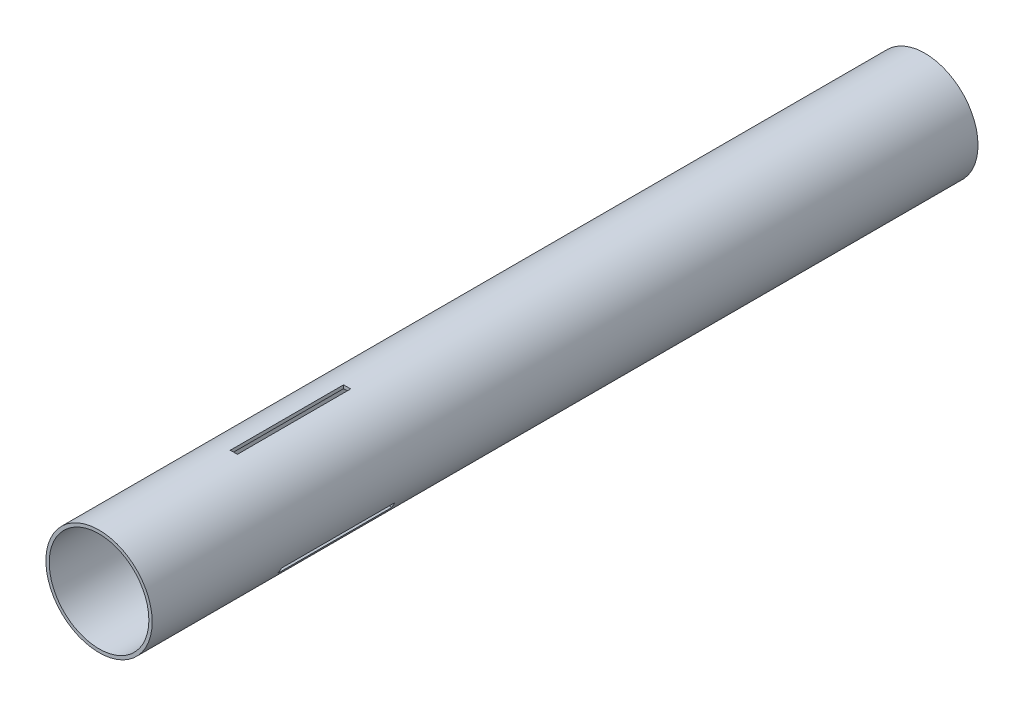
ISO-10303-21;
HEADER;
FILE_DESCRIPTION(('STEP AP214'),'2;1');
FILE_NAME('part.step','',(''),(''),'','','');
FILE_SCHEMA(('AUTOMOTIVE_DESIGN { 1 0 10303 214 1 1 1 1 }'));
ENDSEC;
DATA;
#1=APPLICATION_CONTEXT('core data for automotive mechanical design processes');
#2=APPLICATION_PROTOCOL_DEFINITION('international standard','automotive_design',2000,#1);
#3=PRODUCT_CONTEXT('',#1,'mechanical');
#4=PRODUCT('Part','Part','',(#3));
#5=PRODUCT_RELATED_PRODUCT_CATEGORY('part','',(#4));
#6=PRODUCT_DEFINITION_FORMATION('','',#4);
#7=PRODUCT_DEFINITION_CONTEXT('part definition',#1,'design');
#8=PRODUCT_DEFINITION('design','',#6,#7);
#9=PRODUCT_DEFINITION_SHAPE('','',#8);
#10=(LENGTH_UNIT() NAMED_UNIT(*) SI_UNIT(.MILLI.,.METRE.));
#11=(NAMED_UNIT(*) PLANE_ANGLE_UNIT() SI_UNIT($,.RADIAN.));
#12=(NAMED_UNIT(*) SI_UNIT($,.STERADIAN.) SOLID_ANGLE_UNIT());
#13=UNCERTAINTY_MEASURE_WITH_UNIT(LENGTH_MEASURE(1.E-05),#10,'distance_accuracy_value','');
#14=(GEOMETRIC_REPRESENTATION_CONTEXT(3) GLOBAL_UNCERTAINTY_ASSIGNED_CONTEXT((#13)) GLOBAL_UNIT_ASSIGNED_CONTEXT((#10,
#11,#12)) REPRESENTATION_CONTEXT('',''));
#15=CARTESIAN_POINT('',(0.,0.,0.));
#16=DIRECTION('',(0.,0.,1.));
#17=DIRECTION('',(1.,0.,0.));
#18=AXIS2_PLACEMENT_3D('',#15,#16,#17);
#19=CARTESIAN_POINT('',(0.,0.,368.3));
#20=DIRECTION('',(0.,0.,1.));
#21=DIRECTION('',(1.,0.,0.));
#22=AXIS2_PLACEMENT_3D('',#19,#20,#21);
#23=PLANE('',#22);
#24=CARTESIAN_POINT('',(0.,0.,368.3));
#25=DIRECTION('',(0.,0.,1.));
#26=DIRECTION('',(1.,0.,0.));
#27=AXIS2_PLACEMENT_3D('',#24,#25,#26);
#28=CIRCLE('',#27,23.6982);
#29=CARTESIAN_POINT('',(23.6982,0.,368.3));
#30=VERTEX_POINT('',#29);
#31=EDGE_CURVE('E11',#30,#30,#28,.T.);
#32=ORIENTED_EDGE('',*,*,#31,.T.);
#33=EDGE_LOOP('',(#32));
#34=FACE_BOUND('',#33,.T.);
#35=CARTESIAN_POINT('',(0.,0.,368.3));
#36=DIRECTION('',(0.,0.,1.));
#37=DIRECTION('',(1.,0.,0.));
#38=AXIS2_PLACEMENT_3D('',#35,#36,#37);
#39=CIRCLE('',#38,22.225);
#40=CARTESIAN_POINT('',(22.225,0.,368.3));
#41=VERTEX_POINT('',#40);
#42=EDGE_CURVE('E225',#41,#41,#39,.T.);
#43=ORIENTED_EDGE('',*,*,#42,.F.);
#44=EDGE_LOOP('',(#43));
#45=FACE_BOUND('',#44,.T.);
#46=ADVANCED_FACE('F33',(#34,#45),#23,.T.);
#47=CARTESIAN_POINT('',(0.,0.,0.));
#48=DIRECTION('',(0.,0.,1.));
#49=DIRECTION('',(1.,0.,0.));
#50=AXIS2_PLACEMENT_3D('',#47,#48,#49);
#51=PLANE('',#50);
#52=CARTESIAN_POINT('',(0.,0.,0.));
#53=DIRECTION('',(0.,0.,1.));
#54=DIRECTION('',(1.,0.,0.));
#55=AXIS2_PLACEMENT_3D('',#52,#53,#54);
#56=CIRCLE('',#55,23.6982);
#57=CARTESIAN_POINT('',(23.6982,0.,0.));
#58=VERTEX_POINT('',#57);
#59=EDGE_CURVE('E37',#58,#58,#56,.T.);
#60=ORIENTED_EDGE('',*,*,#59,.F.);
#61=EDGE_LOOP('',(#60));
#62=FACE_BOUND('',#61,.T.);
#63=CARTESIAN_POINT('',(0.,0.,0.));
#64=DIRECTION('',(0.,0.,1.));
#65=DIRECTION('',(1.,0.,0.));
#66=AXIS2_PLACEMENT_3D('',#63,#64,#65);
#67=CIRCLE('',#66,22.225);
#68=CARTESIAN_POINT('',(22.225,0.,0.));
#69=VERTEX_POINT('',#68);
#70=EDGE_CURVE('E224',#69,#69,#67,.T.);
#71=ORIENTED_EDGE('',*,*,#70,.T.);
#72=EDGE_LOOP('',(#71));
#73=FACE_BOUND('',#72,.T.);
#74=ADVANCED_FACE('F231',(#62,#73),#51,.F.);
#75=CARTESIAN_POINT('',(0.,0.,368.3));
#76=DIRECTION('',(0.,0.,-1.));
#77=DIRECTION('',(-1.,0.,0.));
#78=AXIS2_PLACEMENT_3D('',#75,#76,#77);
#79=CYLINDRICAL_SURFACE('',#78,23.6982);
#80=CARTESIAN_POINT('',(0.,0.,257.683));
#81=DIRECTION('',(0.,0.,-1.));
#82=DIRECTION('',(0.,1.,0.));
#83=AXIS2_PLACEMENT_3D('',#80,#81,#82);
#84=CIRCLE('',#83,23.6982);
#85=CARTESIAN_POINT('',(-21.2708932392924,-10.4476688329323,257.683));
#86=VERTEX_POINT('',#85);
#87=CARTESIAN_POINT('',(-19.6833932392924,-13.1972994899479,257.683));
#88=VERTEX_POINT('',#87);
#89=EDGE_CURVE('E138',#86,#88,#84,.F.);
#90=ORIENTED_EDGE('',*,*,#89,.F.);
#91=DIRECTION('',(0.,0.,-1.));
#92=VECTOR('',#91,1.);
#93=CARTESIAN_POINT('',(-21.2708932392924,-10.4476688329323,368.3));
#94=LINE('',#93,#92);
#95=CARTESIAN_POINT('',(-21.2708932392924,-10.4476688329323,308.229));
#96=VERTEX_POINT('',#95);
#97=EDGE_CURVE('E163',#96,#86,#94,.T.);
#98=ORIENTED_EDGE('',*,*,#97,.F.);
#99=CARTESIAN_POINT('',(0.,0.,308.229));
#100=DIRECTION('',(0.,0.,1.));
#101=DIRECTION('',(1.,0.,0.));
#102=AXIS2_PLACEMENT_3D('',#99,#100,#101);
#103=CIRCLE('',#102,23.6982);
#104=CARTESIAN_POINT('',(-19.6833932392924,-13.1972994899479,308.229));
#105=VERTEX_POINT('',#104);
#106=EDGE_CURVE('E155',#105,#96,#103,.F.);
#107=ORIENTED_EDGE('',*,*,#106,.F.);
#108=DIRECTION('',(0.,0.,-1.));
#109=VECTOR('',#108,1.);
#110=CARTESIAN_POINT('',(-19.6833932392924,-13.1972994899479,368.3));
#111=LINE('',#110,#109);
#112=EDGE_CURVE('E48',#88,#105,#111,.F.);
#113=ORIENTED_EDGE('',*,*,#112,.F.);
#114=EDGE_LOOP('',(#90,#98,#107,#113));
#115=FACE_BOUND('',#114,.T.);
#116=CARTESIAN_POINT('',(0.,0.,257.683));
#117=DIRECTION('',(0.,0.,-1.));
#118=DIRECTION('',(0.,1.,0.));
#119=AXIS2_PLACEMENT_3D('',#116,#117,#118);
#120=CIRCLE('',#119,23.6982);
#121=CARTESIAN_POINT('',(19.6833932392926,-13.1972994899476,257.683));
#122=VERTEX_POINT('',#121);
#123=CARTESIAN_POINT('',(21.2708932392925,-10.447668832932,257.683));
#124=VERTEX_POINT('',#123);
#125=EDGE_CURVE('E176',#122,#124,#120,.F.);
#126=ORIENTED_EDGE('',*,*,#125,.F.);
#127=DIRECTION('',(0.,0.,-1.));
#128=VECTOR('',#127,1.);
#129=CARTESIAN_POINT('',(19.6833932392926,-13.1972994899476,368.3));
#130=LINE('',#129,#128);
#131=CARTESIAN_POINT('',(19.6833932392926,-13.1972994899476,308.229));
#132=VERTEX_POINT('',#131);
#133=EDGE_CURVE('E146',#132,#122,#130,.T.);
#134=ORIENTED_EDGE('',*,*,#133,.F.);
#135=CARTESIAN_POINT('',(0.,0.,308.229));
#136=DIRECTION('',(0.,0.,1.));
#137=DIRECTION('',(1.,0.,0.));
#138=AXIS2_PLACEMENT_3D('',#135,#136,#137);
#139=CIRCLE('',#138,23.6982);
#140=CARTESIAN_POINT('',(21.2708932392925,-10.447668832932,308.229));
#141=VERTEX_POINT('',#140);
#142=EDGE_CURVE('E180',#141,#132,#139,.F.);
#143=ORIENTED_EDGE('',*,*,#142,.F.);
#144=DIRECTION('',(0.,0.,-1.));
#145=VECTOR('',#144,1.);
#146=CARTESIAN_POINT('',(21.2708932392925,-10.447668832932,368.3));
#147=LINE('',#146,#145);
#148=EDGE_CURVE('E56',#124,#141,#147,.F.);
#149=ORIENTED_EDGE('',*,*,#148,.F.);
#150=EDGE_LOOP('',(#126,#134,#143,#149));
#151=FACE_BOUND('',#150,.T.);
#152=CARTESIAN_POINT('',(0.,0.,257.683));
#153=DIRECTION('',(0.,0.,-1.));
#154=DIRECTION('',(-1.,0.,0.));
#155=AXIS2_PLACEMENT_3D('',#152,#153,#154);
#156=CIRCLE('',#155,23.6982);
#157=CARTESIAN_POINT('',(1.5875,23.64496832288,257.683));
#158=VERTEX_POINT('',#157);
#159=CARTESIAN_POINT('',(-1.5875,23.64496832288,257.683));
#160=VERTEX_POINT('',#159);
#161=EDGE_CURVE('E201',#158,#160,#156,.F.);
#162=ORIENTED_EDGE('',*,*,#161,.F.);
#163=DIRECTION('',(0.,0.,-1.));
#164=VECTOR('',#163,1.);
#165=CARTESIAN_POINT('',(1.5875,23.64496832288,368.3));
#166=LINE('',#165,#164);
#167=CARTESIAN_POINT('',(1.5875,23.64496832288,308.229));
#168=VERTEX_POINT('',#167);
#169=EDGE_CURVE('E221',#168,#158,#166,.T.);
#170=ORIENTED_EDGE('',*,*,#169,.F.);
#171=CARTESIAN_POINT('',(0.,0.,308.229));
#172=DIRECTION('',(0.,0.,1.));
#173=DIRECTION('',(1.,0.,0.));
#174=AXIS2_PLACEMENT_3D('',#171,#172,#173);
#175=CIRCLE('',#174,23.6982);
#176=CARTESIAN_POINT('',(-1.5875,23.64496832288,308.229));
#177=VERTEX_POINT('',#176);
#178=EDGE_CURVE('E206',#177,#168,#175,.F.);
#179=ORIENTED_EDGE('',*,*,#178,.F.);
#180=DIRECTION('',(0.,0.,-1.));
#181=VECTOR('',#180,1.);
#182=CARTESIAN_POINT('',(-1.5875,23.64496832288,368.3));
#183=LINE('',#182,#181);
#184=EDGE_CURVE('E204',#160,#177,#183,.F.);
#185=ORIENTED_EDGE('',*,*,#184,.F.);
#186=EDGE_LOOP('',(#162,#170,#179,#185));
#187=FACE_BOUND('',#186,.T.);
#188=ORIENTED_EDGE('',*,*,#31,.F.);
#189=EDGE_LOOP('',(#188));
#190=FACE_BOUND('',#189,.T.);
#191=ORIENTED_EDGE('',*,*,#59,.T.);
#192=EDGE_LOOP('',(#191));
#193=FACE_BOUND('',#192,.T.);
#194=ADVANCED_FACE('F35',(#115,#151,#187,#190,#193),#79,.T.);
#195=CARTESIAN_POINT('',(0.,0.,368.3));
#196=DIRECTION('',(0.,0.,-1.));
#197=DIRECTION('',(-1.,0.,0.));
#198=AXIS2_PLACEMENT_3D('',#195,#196,#197);
#199=CYLINDRICAL_SURFACE('',#198,22.225);
#200=DIRECTION('',(0.,0.,-1.));
#201=VECTOR('',#200,1.);
#202=CARTESIAN_POINT('',(-19.9920012631359,-9.70930020623389,368.3));
#203=LINE('',#202,#201);
#204=CARTESIAN_POINT('',(-19.9920012631359,-9.70930020623389,308.229));
#205=VERTEX_POINT('',#204);
#206=CARTESIAN_POINT('',(-19.9920012631359,-9.70930020623389,257.683));
#207=VERTEX_POINT('',#206);
#208=EDGE_CURVE('E145',#205,#207,#203,.T.);
#209=ORIENTED_EDGE('',*,*,#208,.T.);
#210=CARTESIAN_POINT('',(0.,0.,257.683));
#211=DIRECTION('',(0.,0.,-1.));
#212=DIRECTION('',(0.,1.,0.));
#213=AXIS2_PLACEMENT_3D('',#210,#211,#212);
#214=CIRCLE('',#213,22.225);
#215=CARTESIAN_POINT('',(-18.4045012631359,-12.4589308632495,257.683));
#216=VERTEX_POINT('',#215);
#217=EDGE_CURVE('E132',#207,#216,#214,.F.);
#218=ORIENTED_EDGE('',*,*,#217,.T.);
#219=DIRECTION('',(0.,0.,-1.));
#220=VECTOR('',#219,1.);
#221=CARTESIAN_POINT('',(-18.4045012631359,-12.4589308632495,368.3));
#222=LINE('',#221,#220);
#223=CARTESIAN_POINT('',(-18.4045012631359,-12.4589308632495,308.229));
#224=VERTEX_POINT('',#223);
#225=EDGE_CURVE('E122',#216,#224,#222,.F.);
#226=ORIENTED_EDGE('',*,*,#225,.T.);
#227=CARTESIAN_POINT('',(0.,0.,308.229));
#228=DIRECTION('',(0.,0.,1.));
#229=DIRECTION('',(1.,0.,0.));
#230=AXIS2_PLACEMENT_3D('',#227,#228,#229);
#231=CIRCLE('',#230,22.225);
#232=EDGE_CURVE('E131',#224,#205,#231,.F.);
#233=ORIENTED_EDGE('',*,*,#232,.T.);
#234=EDGE_LOOP('',(#209,#218,#226,#233));
#235=FACE_BOUND('',#234,.T.);
#236=DIRECTION('',(0.,0.,-1.));
#237=VECTOR('',#236,1.);
#238=CARTESIAN_POINT('',(18.404501263136,-12.4589308632492,368.3));
#239=LINE('',#238,#237);
#240=CARTESIAN_POINT('',(18.404501263136,-12.4589308632492,308.229));
#241=VERTEX_POINT('',#240);
#242=CARTESIAN_POINT('',(18.404501263136,-12.4589308632492,257.683));
#243=VERTEX_POINT('',#242);
#244=EDGE_CURVE('E149',#241,#243,#239,.T.);
#245=ORIENTED_EDGE('',*,*,#244,.T.);
#246=CARTESIAN_POINT('',(0.,0.,257.683));
#247=DIRECTION('',(0.,0.,-1.));
#248=DIRECTION('',(0.,1.,0.));
#249=AXIS2_PLACEMENT_3D('',#246,#247,#248);
#250=CIRCLE('',#249,22.225);
#251=CARTESIAN_POINT('',(19.992001263136,-9.70930020623361,257.683));
#252=VERTEX_POINT('',#251);
#253=EDGE_CURVE('E167',#243,#252,#250,.F.);
#254=ORIENTED_EDGE('',*,*,#253,.T.);
#255=DIRECTION('',(0.,0.,-1.));
#256=VECTOR('',#255,1.);
#257=CARTESIAN_POINT('',(19.992001263136,-9.70930020623361,368.3));
#258=LINE('',#257,#256);
#259=CARTESIAN_POINT('',(19.992001263136,-9.70930020623361,308.229));
#260=VERTEX_POINT('',#259);
#261=EDGE_CURVE('E170',#252,#260,#258,.F.);
#262=ORIENTED_EDGE('',*,*,#261,.T.);
#263=CARTESIAN_POINT('',(0.,0.,308.229));
#264=DIRECTION('',(0.,0.,1.));
#265=DIRECTION('',(1.,0.,0.));
#266=AXIS2_PLACEMENT_3D('',#263,#264,#265);
#267=CIRCLE('',#266,22.225);
#268=EDGE_CURVE('E173',#260,#241,#267,.F.);
#269=ORIENTED_EDGE('',*,*,#268,.T.);
#270=EDGE_LOOP('',(#245,#254,#262,#269));
#271=FACE_BOUND('',#270,.T.);
#272=DIRECTION('',(0.,0.,-1.));
#273=VECTOR('',#272,1.);
#274=CARTESIAN_POINT('',(1.5875,22.1682310694832,368.3));
#275=LINE('',#274,#273);
#276=CARTESIAN_POINT('',(1.5875,22.1682310694832,308.229));
#277=VERTEX_POINT('',#276);
#278=CARTESIAN_POINT('',(1.5875,22.1682310694832,257.683));
#279=VERTEX_POINT('',#278);
#280=EDGE_CURVE('E213',#277,#279,#275,.T.);
#281=ORIENTED_EDGE('',*,*,#280,.T.);
#282=CARTESIAN_POINT('',(0.,0.,257.683));
#283=DIRECTION('',(0.,0.,-1.));
#284=DIRECTION('',(-1.,0.,0.));
#285=AXIS2_PLACEMENT_3D('',#282,#283,#284);
#286=CIRCLE('',#285,22.225);
#287=CARTESIAN_POINT('',(-1.5875,22.1682310694832,257.683));
#288=VERTEX_POINT('',#287);
#289=EDGE_CURVE('E166',#279,#288,#286,.F.);
#290=ORIENTED_EDGE('',*,*,#289,.T.);
#291=DIRECTION('',(0.,0.,-1.));
#292=VECTOR('',#291,1.);
#293=CARTESIAN_POINT('',(-1.5875,22.1682310694832,368.3));
#294=LINE('',#293,#292);
#295=CARTESIAN_POINT('',(-1.5875,22.1682310694832,308.229));
#296=VERTEX_POINT('',#295);
#297=EDGE_CURVE('E195',#288,#296,#294,.F.);
#298=ORIENTED_EDGE('',*,*,#297,.T.);
#299=CARTESIAN_POINT('',(0.,0.,308.229));
#300=DIRECTION('',(0.,0.,1.));
#301=DIRECTION('',(1.,0.,0.));
#302=AXIS2_PLACEMENT_3D('',#299,#300,#301);
#303=CIRCLE('',#302,22.225);
#304=EDGE_CURVE('E198',#296,#277,#303,.F.);
#305=ORIENTED_EDGE('',*,*,#304,.T.);
#306=EDGE_LOOP('',(#281,#290,#298,#305));
#307=FACE_BOUND('',#306,.T.);
#308=ORIENTED_EDGE('',*,*,#42,.T.);
#309=EDGE_LOOP('',(#308));
#310=FACE_BOUND('',#309,.T.);
#311=ORIENTED_EDGE('',*,*,#70,.F.);
#312=EDGE_LOOP('',(#311));
#313=FACE_BOUND('',#312,.T.);
#314=ADVANCED_FACE('F142',(#235,#271,#307,#310,#313),#199,.F.);
#315=CARTESIAN_POINT('',(1.5875,-23.6992,308.229));
#316=DIRECTION('',(1.,0.,0.));
#317=DIRECTION('',(0.,0.,-1.));
#318=AXIS2_PLACEMENT_3D('',#315,#316,#317);
#319=PLANE('',#318);
#320=ORIENTED_EDGE('',*,*,#169,.T.);
#321=DIRECTION('',(0.,1.,0.));
#322=VECTOR('',#321,1.);
#323=CARTESIAN_POINT('',(1.5875,-23.6992,257.683));
#324=LINE('',#323,#322);
#325=EDGE_CURVE('E216',#279,#158,#324,.T.);
#326=ORIENTED_EDGE('',*,*,#325,.F.);
#327=ORIENTED_EDGE('',*,*,#280,.F.);
#328=DIRECTION('',(0.,1.,0.));
#329=VECTOR('',#328,1.);
#330=CARTESIAN_POINT('',(1.5875,-23.6992,308.229));
#331=LINE('',#330,#329);
#332=EDGE_CURVE('E209',#277,#168,#331,.T.);
#333=ORIENTED_EDGE('',*,*,#332,.T.);
#334=EDGE_LOOP('',(#320,#326,#327,#333));
#335=FACE_BOUND('',#334,.T.);
#336=ADVANCED_FACE('F234',(#335),#319,.F.);
#337=CARTESIAN_POINT('',(-1.5875,-23.6992,257.683));
#338=DIRECTION('',(0.,0.,-1.));
#339=DIRECTION('',(-1.,0.,0.));
#340=AXIS2_PLACEMENT_3D('',#337,#338,#339);
#341=PLANE('',#340);
#342=ORIENTED_EDGE('',*,*,#161,.T.);
#343=DIRECTION('',(0.,1.,0.));
#344=VECTOR('',#343,1.);
#345=CARTESIAN_POINT('',(-1.5875,-23.6992,257.683));
#346=LINE('',#345,#344);
#347=EDGE_CURVE('E214',#288,#160,#346,.T.);
#348=ORIENTED_EDGE('',*,*,#347,.F.);
#349=ORIENTED_EDGE('',*,*,#289,.F.);
#350=ORIENTED_EDGE('',*,*,#325,.T.);
#351=EDGE_LOOP('',(#342,#348,#349,#350));
#352=FACE_BOUND('',#351,.T.);
#353=ADVANCED_FACE('F240',(#352),#341,.F.);
#354=CARTESIAN_POINT('',(-1.5875,-23.6992,308.229));
#355=DIRECTION('',(-1.,0.,0.));
#356=DIRECTION('',(0.,0.,1.));
#357=AXIS2_PLACEMENT_3D('',#354,#355,#356);
#358=PLANE('',#357);
#359=ORIENTED_EDGE('',*,*,#184,.T.);
#360=DIRECTION('',(0.,1.,0.));
#361=VECTOR('',#360,1.);
#362=CARTESIAN_POINT('',(-1.5875,-23.6992,308.229));
#363=LINE('',#362,#361);
#364=EDGE_CURVE('E210',#296,#177,#363,.T.);
#365=ORIENTED_EDGE('',*,*,#364,.F.);
#366=ORIENTED_EDGE('',*,*,#297,.F.);
#367=ORIENTED_EDGE('',*,*,#347,.T.);
#368=EDGE_LOOP('',(#359,#365,#366,#367));
#369=FACE_BOUND('',#368,.T.);
#370=ADVANCED_FACE('F358',(#369),#358,.F.);
#371=CARTESIAN_POINT('',(-1.5875,-23.6992,308.229));
#372=DIRECTION('',(0.,0.,1.));
#373=DIRECTION('',(1.,0.,0.));
#374=AXIS2_PLACEMENT_3D('',#371,#372,#373);
#375=PLANE('',#374);
#376=ORIENTED_EDGE('',*,*,#178,.T.);
#377=ORIENTED_EDGE('',*,*,#332,.F.);
#378=ORIENTED_EDGE('',*,*,#304,.F.);
#379=ORIENTED_EDGE('',*,*,#364,.T.);
#380=EDGE_LOOP('',(#376,#377,#378,#379));
#381=FACE_BOUND('',#380,.T.);
#382=ADVANCED_FACE('F273',(#381),#375,.F.);
#383=CARTESIAN_POINT('',(-28.8302046246841,14.812039296176,308.229));
#384=DIRECTION('',(-0.499999999999992,-0.866025403784443,0.));
#385=DIRECTION('',(0.866025403784443,-0.499999999999992,0.));
#386=AXIS2_PLACEMENT_3D('',#383,#384,#385);
#387=PLANE('',#386);
#388=ORIENTED_EDGE('',*,*,#133,.T.);
#389=DIRECTION('',(0.866025403784443,-0.499999999999992,0.));
#390=VECTOR('',#389,1.);
#391=CARTESIAN_POINT('',(-28.8302046246841,14.812039296176,257.683));
#392=LINE('',#391,#390);
#393=EDGE_CURVE('E188',#243,#122,#392,.T.);
#394=ORIENTED_EDGE('',*,*,#393,.F.);
#395=ORIENTED_EDGE('',*,*,#244,.F.);
#396=DIRECTION('',(0.866025403784443,-0.499999999999992,0.));
#397=VECTOR('',#396,1.);
#398=CARTESIAN_POINT('',(-28.8302046246841,14.812039296176,308.229));
#399=LINE('',#398,#397);
#400=EDGE_CURVE('E183',#241,#132,#399,.T.);
#401=ORIENTED_EDGE('',*,*,#400,.T.);
#402=EDGE_LOOP('',(#388,#394,#395,#401));
#403=FACE_BOUND('',#402,.T.);
#404=ADVANCED_FACE('F283',(#403),#387,.F.);
#405=CARTESIAN_POINT('',(-27.2427046246842,17.5616699531916,257.683));
#406=DIRECTION('',(0.,0.,-1.));
#407=DIRECTION('',(0.,1.,0.));
#408=AXIS2_PLACEMENT_3D('',#405,#406,#407);
#409=PLANE('',#408);
#410=ORIENTED_EDGE('',*,*,#125,.T.);
#411=DIRECTION('',(0.866025403784443,-0.499999999999992,0.));
#412=VECTOR('',#411,1.);
#413=CARTESIAN_POINT('',(-27.2427046246842,17.5616699531916,257.683));
#414=LINE('',#413,#412);
#415=EDGE_CURVE('E186',#252,#124,#414,.T.);
#416=ORIENTED_EDGE('',*,*,#415,.F.);
#417=ORIENTED_EDGE('',*,*,#253,.F.);
#418=ORIENTED_EDGE('',*,*,#393,.T.);
#419=EDGE_LOOP('',(#410,#416,#417,#418));
#420=FACE_BOUND('',#419,.T.);
#421=ADVANCED_FACE('F288',(#420),#409,.F.);
#422=CARTESIAN_POINT('',(-27.2427046246842,17.5616699531916,308.229));
#423=DIRECTION('',(0.499999999999992,0.866025403784443,0.));
#424=DIRECTION('',(-0.866025403784443,0.499999999999992,0.));
#425=AXIS2_PLACEMENT_3D('',#422,#423,#424);
#426=PLANE('',#425);
#427=ORIENTED_EDGE('',*,*,#148,.T.);
#428=DIRECTION('',(0.866025403784443,-0.499999999999992,0.));
#429=VECTOR('',#428,1.);
#430=CARTESIAN_POINT('',(-27.2427046246842,17.5616699531916,308.229));
#431=LINE('',#430,#429);
#432=EDGE_CURVE('E184',#260,#141,#431,.T.);
#433=ORIENTED_EDGE('',*,*,#432,.F.);
#434=ORIENTED_EDGE('',*,*,#261,.F.);
#435=ORIENTED_EDGE('',*,*,#415,.T.);
#436=EDGE_LOOP('',(#427,#433,#434,#435));
#437=FACE_BOUND('',#436,.T.);
#438=ADVANCED_FACE('F298',(#437),#426,.F.);
#439=CARTESIAN_POINT('',(-27.2427046246842,17.5616699531916,308.229));
#440=DIRECTION('',(0.,0.,1.));
#441=DIRECTION('',(1.,0.,0.));
#442=AXIS2_PLACEMENT_3D('',#439,#440,#441);
#443=PLANE('',#442);
#444=ORIENTED_EDGE('',*,*,#142,.T.);
#445=ORIENTED_EDGE('',*,*,#400,.F.);
#446=ORIENTED_EDGE('',*,*,#268,.F.);
#447=ORIENTED_EDGE('',*,*,#432,.T.);
#448=EDGE_LOOP('',(#444,#445,#446,#447));
#449=FACE_BOUND('',#448,.T.);
#450=ADVANCED_FACE('F308',(#449),#443,.F.);
#451=CARTESIAN_POINT('',(27.242704624684,17.561669953192,308.229));
#452=DIRECTION('',(-0.500000000000004,0.866025403784436,0.));
#453=DIRECTION('',(-0.866025403784436,-0.500000000000004,0.));
#454=AXIS2_PLACEMENT_3D('',#451,#452,#453);
#455=PLANE('',#454);
#456=ORIENTED_EDGE('',*,*,#97,.T.);
#457=DIRECTION('',(-0.866025403784436,-0.500000000000004,0.));
#458=VECTOR('',#457,1.);
#459=CARTESIAN_POINT('',(27.242704624684,17.561669953192,257.683));
#460=LINE('',#459,#458);
#461=EDGE_CURVE('E139',#207,#86,#460,.T.);
#462=ORIENTED_EDGE('',*,*,#461,.F.);
#463=ORIENTED_EDGE('',*,*,#208,.F.);
#464=DIRECTION('',(-0.866025403784436,-0.500000000000004,0.));
#465=VECTOR('',#464,1.);
#466=CARTESIAN_POINT('',(27.242704624684,17.561669953192,308.229));
#467=LINE('',#466,#465);
#468=EDGE_CURVE('E158',#205,#96,#467,.T.);
#469=ORIENTED_EDGE('',*,*,#468,.T.);
#470=EDGE_LOOP('',(#456,#462,#463,#469));
#471=FACE_BOUND('',#470,.T.);
#472=ADVANCED_FACE('F317',(#471),#455,.F.);
#473=CARTESIAN_POINT('',(28.830204624684,14.8120392961764,257.683));
#474=DIRECTION('',(0.,0.,-1.));
#475=DIRECTION('',(0.,1.,0.));
#476=AXIS2_PLACEMENT_3D('',#473,#474,#475);
#477=PLANE('',#476);
#478=ORIENTED_EDGE('',*,*,#89,.T.);
#479=DIRECTION('',(-0.866025403784436,-0.500000000000004,0.));
#480=VECTOR('',#479,1.);
#481=CARTESIAN_POINT('',(28.830204624684,14.8120392961764,257.683));
#482=LINE('',#481,#480);
#483=EDGE_CURVE('E125',#216,#88,#482,.T.);
#484=ORIENTED_EDGE('',*,*,#483,.F.);
#485=ORIENTED_EDGE('',*,*,#217,.F.);
#486=ORIENTED_EDGE('',*,*,#461,.T.);
#487=EDGE_LOOP('',(#478,#484,#485,#486));
#488=FACE_BOUND('',#487,.T.);
#489=ADVANCED_FACE('F135',(#488),#477,.F.);
#490=CARTESIAN_POINT('',(28.830204624684,14.8120392961764,308.229));
#491=DIRECTION('',(0.500000000000004,-0.866025403784436,0.));
#492=DIRECTION('',(0.866025403784436,0.500000000000004,0.));
#493=AXIS2_PLACEMENT_3D('',#490,#491,#492);
#494=PLANE('',#493);
#495=ORIENTED_EDGE('',*,*,#112,.T.);
#496=DIRECTION('',(-0.866025403784436,-0.500000000000004,0.));
#497=VECTOR('',#496,1.);
#498=CARTESIAN_POINT('',(28.830204624684,14.8120392961764,308.229));
#499=LINE('',#498,#497);
#500=EDGE_CURVE('E127',#224,#105,#499,.T.);
#501=ORIENTED_EDGE('',*,*,#500,.F.);
#502=ORIENTED_EDGE('',*,*,#225,.F.);
#503=ORIENTED_EDGE('',*,*,#483,.T.);
#504=EDGE_LOOP('',(#495,#501,#502,#503));
#505=FACE_BOUND('',#504,.T.);
#506=ADVANCED_FACE('F124',(#505),#494,.F.);
#507=CARTESIAN_POINT('',(28.830204624684,14.8120392961764,308.229));
#508=DIRECTION('',(0.,0.,1.));
#509=DIRECTION('',(1.,0.,0.));
#510=AXIS2_PLACEMENT_3D('',#507,#508,#509);
#511=PLANE('',#510);
#512=ORIENTED_EDGE('',*,*,#106,.T.);
#513=ORIENTED_EDGE('',*,*,#468,.F.);
#514=ORIENTED_EDGE('',*,*,#232,.F.);
#515=ORIENTED_EDGE('',*,*,#500,.T.);
#516=EDGE_LOOP('',(#512,#513,#514,#515));
#517=FACE_BOUND('',#516,.T.);
#518=ADVANCED_FACE('F344',(#517),#511,.F.);
#519=CLOSED_SHELL('',(#46,#74,#194,#314,#336,#353,#370,#382,#404,#421,#438,#450,#472,#489,#506,#518));
#520=MANIFOLD_SOLID_BREP('B2',#519);
#521=ADVANCED_BREP_SHAPE_REPRESENTATION('',(#18,#520),#14);
#522=SHAPE_DEFINITION_REPRESENTATION(#9,#521);
ENDSEC;
END-ISO-10303-21;
